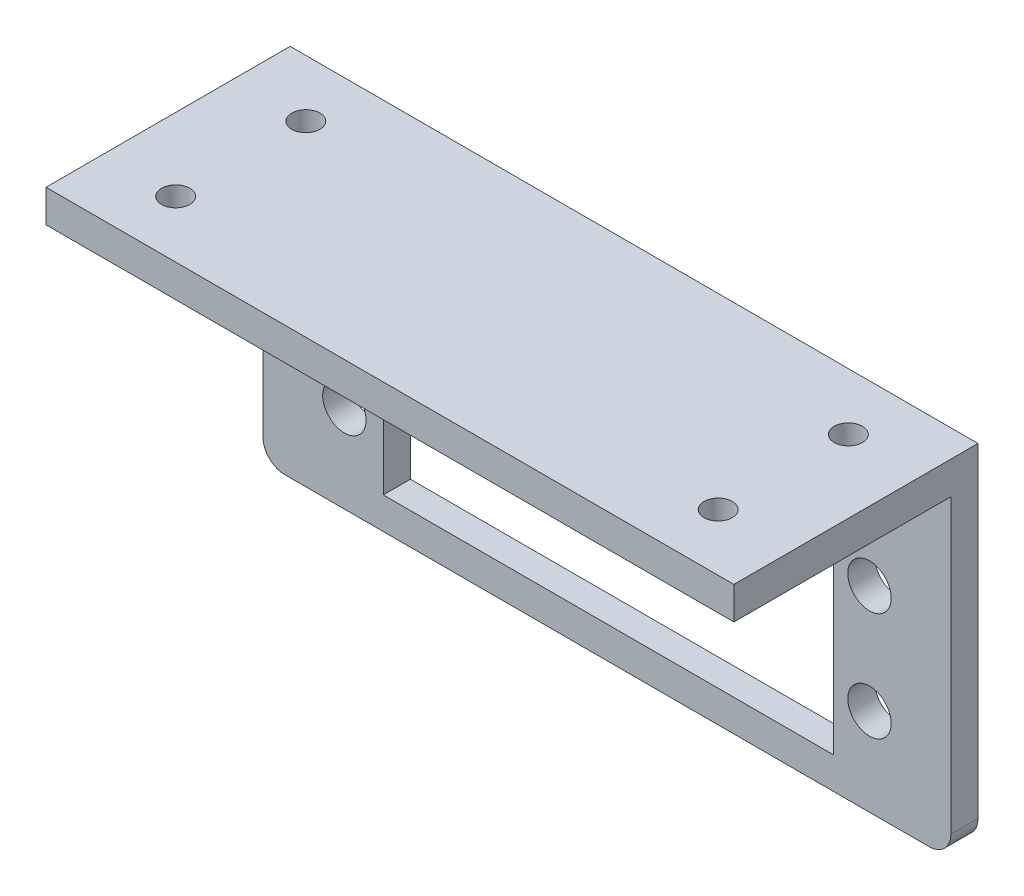
ISO-10303-21;
HEADER;
FILE_DESCRIPTION(('STEP AP214'),'2;1');
FILE_NAME('part.step','',(''),(''),'','','');
FILE_SCHEMA(('AUTOMOTIVE_DESIGN { 1 0 10303 214 1 1 1 1 }'));
ENDSEC;
DATA;
#1=APPLICATION_CONTEXT('core data for automotive mechanical design processes');
#2=APPLICATION_PROTOCOL_DEFINITION('international standard','automotive_design',2000,#1);
#3=PRODUCT_CONTEXT('',#1,'mechanical');
#4=PRODUCT('Part','Part','',(#3));
#5=PRODUCT_RELATED_PRODUCT_CATEGORY('part','',(#4));
#6=PRODUCT_DEFINITION_FORMATION('','',#4);
#7=PRODUCT_DEFINITION_CONTEXT('part definition',#1,'design');
#8=PRODUCT_DEFINITION('design','',#6,#7);
#9=PRODUCT_DEFINITION_SHAPE('','',#8);
#10=(LENGTH_UNIT() NAMED_UNIT(*) SI_UNIT(.MILLI.,.METRE.));
#11=(NAMED_UNIT(*) PLANE_ANGLE_UNIT() SI_UNIT($,.RADIAN.));
#12=(NAMED_UNIT(*) SI_UNIT($,.STERADIAN.) SOLID_ANGLE_UNIT());
#13=UNCERTAINTY_MEASURE_WITH_UNIT(LENGTH_MEASURE(1.E-05),#10,'distance_accuracy_value','');
#14=(GEOMETRIC_REPRESENTATION_CONTEXT(3) GLOBAL_UNCERTAINTY_ASSIGNED_CONTEXT((#13)) GLOBAL_UNIT_ASSIGNED_CONTEXT((#10,
#11,#12)) REPRESENTATION_CONTEXT('',''));
#15=CARTESIAN_POINT('',(0.,0.,0.));
#16=DIRECTION('',(0.,0.,1.));
#17=DIRECTION('',(1.,0.,0.));
#18=AXIS2_PLACEMENT_3D('',#15,#16,#17);
#19=CARTESIAN_POINT('',(9.10277923176895,-2.36025351629169,2.5));
#20=DIRECTION('',(0.,0.,1.));
#21=DIRECTION('',(1.,0.,0.));
#22=AXIS2_PLACEMENT_3D('',#19,#20,#21);
#23=PLANE('',#22);
#24=DIRECTION('',(1.,0.,0.));
#25=VECTOR('',#24,1.);
#26=CARTESIAN_POINT('',(7.10277923176895,24.5774686115369,2.5));
#27=LINE('',#26,#25);
#28=CARTESIAN_POINT('',(7.10277923176896,24.5774686115369,2.5));
#29=VERTEX_POINT('',#28);
#30=CARTESIAN_POINT('',(70.5028221491274,24.5774686115369,2.5));
#31=VERTEX_POINT('',#30);
#32=EDGE_CURVE('E52',#29,#31,#27,.T.);
#33=ORIENTED_EDGE('',*,*,#32,.F.);
#34=DIRECTION('',(0.,-1.,0.));
#35=VECTOR('',#34,1.);
#36=CARTESIAN_POINT('',(7.10277923176896,-2.36025351629169,2.5));
#37=LINE('',#36,#35);
#38=CARTESIAN_POINT('',(7.10277923176896,-2.36025351629169,2.5));
#39=VERTEX_POINT('',#38);
#40=EDGE_CURVE('E149',#29,#39,#37,.T.);
#41=ORIENTED_EDGE('',*,*,#40,.T.);
#42=CARTESIAN_POINT('',(9.10277923176895,-2.36025351629169,2.5));
#43=DIRECTION('',(0.,0.,1.));
#44=DIRECTION('',(1.,0.,0.));
#45=AXIS2_PLACEMENT_3D('',#42,#43,#44);
#46=CIRCLE('',#45,2.);
#47=CARTESIAN_POINT('',(9.10277923176895,-4.36025351629169,2.5));
#48=VERTEX_POINT('',#47);
#49=EDGE_CURVE('E212',#39,#48,#46,.T.);
#50=ORIENTED_EDGE('',*,*,#49,.T.);
#51=DIRECTION('',(1.,0.,0.));
#52=VECTOR('',#51,1.);
#53=CARTESIAN_POINT('',(9.10277923176895,-4.36025351629169,2.5));
#54=LINE('',#53,#52);
#55=CARTESIAN_POINT('',(68.5028221491274,-4.36025351629169,2.5));
#56=VERTEX_POINT('',#55);
#57=EDGE_CURVE('E214',#48,#56,#54,.T.);
#58=ORIENTED_EDGE('',*,*,#57,.T.);
#59=CARTESIAN_POINT('',(68.5028221491274,-2.36025351629169,2.5));
#60=DIRECTION('',(0.,0.,1.));
#61=DIRECTION('',(-1.,0.,0.));
#62=AXIS2_PLACEMENT_3D('',#59,#60,#61);
#63=CIRCLE('',#62,2.);
#64=CARTESIAN_POINT('',(70.5028221491274,-2.36025351629169,2.5));
#65=VERTEX_POINT('',#64);
#66=EDGE_CURVE('E216',#56,#65,#63,.T.);
#67=ORIENTED_EDGE('',*,*,#66,.T.);
#68=DIRECTION('',(0.,1.,0.));
#69=VECTOR('',#68,1.);
#70=CARTESIAN_POINT('',(70.5028221491274,-2.36025351629169,2.5));
#71=LINE('',#70,#69);
#72=EDGE_CURVE('E208',#65,#31,#71,.T.);
#73=ORIENTED_EDGE('',*,*,#72,.T.);
#74=EDGE_LOOP('',(#33,#41,#50,#58,#67,#73));
#75=FACE_BOUND('',#74,.T.);
#76=CARTESIAN_POINT('',(63.0028221491273,3.71523363978402,2.5));
#77=DIRECTION('',(0.,0.,1.));
#78=DIRECTION('',(-1.,0.,0.));
#79=AXIS2_PLACEMENT_3D('',#76,#77,#78);
#80=CIRCLE('',#79,2.00000000061193);
#81=CARTESIAN_POINT('',(61.0028221485154,3.71523363978402,2.5));
#82=VERTEX_POINT('',#81);
#83=EDGE_CURVE('E190',#82,#82,#80,.T.);
#84=ORIENTED_EDGE('',*,*,#83,.F.);
#85=EDGE_LOOP('',(#84));
#86=FACE_BOUND('',#85,.T.);
#87=CARTESIAN_POINT('',(14.6027803468909,13.715233639784,2.5));
#88=DIRECTION('',(0.,0.,1.));
#89=DIRECTION('',(1.,0.,0.));
#90=AXIS2_PLACEMENT_3D('',#87,#88,#89);
#91=CIRCLE('',#90,2.);
#92=CARTESIAN_POINT('',(16.6027803468909,13.715233639784,2.5));
#93=VERTEX_POINT('',#92);
#94=EDGE_CURVE('E202',#93,#93,#91,.T.);
#95=ORIENTED_EDGE('',*,*,#94,.F.);
#96=EDGE_LOOP('',(#95));
#97=FACE_BOUND('',#96,.T.);
#98=CARTESIAN_POINT('',(14.602779231769,3.71523363978401,2.5));
#99=DIRECTION('',(0.,0.,1.));
#100=DIRECTION('',(1.,0.,0.));
#101=AXIS2_PLACEMENT_3D('',#98,#99,#100);
#102=CIRCLE('',#101,2.00000000015146);
#103=CARTESIAN_POINT('',(16.6027792319205,3.71523363978401,2.5));
#104=VERTEX_POINT('',#103);
#105=EDGE_CURVE('E196',#104,#104,#102,.T.);
#106=ORIENTED_EDGE('',*,*,#105,.F.);
#107=EDGE_LOOP('',(#106));
#108=FACE_BOUND('',#107,.T.);
#109=CARTESIAN_POINT('',(63.0028210340055,13.715233639784,2.5));
#110=DIRECTION('',(0.,0.,1.));
#111=DIRECTION('',(-1.,0.,0.));
#112=AXIS2_PLACEMENT_3D('',#109,#110,#111);
#113=CIRCLE('',#112,2.);
#114=CARTESIAN_POINT('',(61.0028210340055,13.715233639784,2.5));
#115=VERTEX_POINT('',#114);
#116=EDGE_CURVE('E184',#115,#115,#113,.T.);
#117=ORIENTED_EDGE('',*,*,#116,.F.);
#118=EDGE_LOOP('',(#117));
#119=FACE_BOUND('',#118,.T.);
#120=DIRECTION('',(0.,1.,0.));
#121=VECTOR('',#120,1.);
#122=CARTESIAN_POINT('',(59.6885885433482,-1.43476636021599,2.5));
#123=LINE('',#122,#121);
#124=CARTESIAN_POINT('',(59.6885885433482,-1.43476636021599,2.5));
#125=VERTEX_POINT('',#124);
#126=CARTESIAN_POINT('',(59.6885885433482,19.065233639784,2.5));
#127=VERTEX_POINT('',#126);
#128=EDGE_CURVE('E160',#125,#127,#123,.T.);
#129=ORIENTED_EDGE('',*,*,#128,.F.);
#130=DIRECTION('',(1.,0.,0.));
#131=VECTOR('',#130,1.);
#132=CARTESIAN_POINT('',(18.1885885433482,-1.43476636021599,2.5));
#133=LINE('',#132,#131);
#134=CARTESIAN_POINT('',(18.1885885433482,-1.43476636021599,2.5));
#135=VERTEX_POINT('',#134);
#136=EDGE_CURVE('E158',#135,#125,#133,.T.);
#137=ORIENTED_EDGE('',*,*,#136,.F.);
#138=DIRECTION('',(0.,-1.,0.));
#139=VECTOR('',#138,1.);
#140=CARTESIAN_POINT('',(18.1885885433482,-1.43476636021599,2.5));
#141=LINE('',#140,#139);
#142=CARTESIAN_POINT('',(18.1885885433482,19.065233639784,2.5));
#143=VERTEX_POINT('',#142);
#144=EDGE_CURVE('E165',#143,#135,#141,.T.);
#145=ORIENTED_EDGE('',*,*,#144,.F.);
#146=DIRECTION('',(-1.,0.,0.));
#147=VECTOR('',#146,1.);
#148=CARTESIAN_POINT('',(18.1885885433482,19.065233639784,2.5));
#149=LINE('',#148,#147);
#150=EDGE_CURVE('E163',#127,#143,#149,.T.);
#151=ORIENTED_EDGE('',*,*,#150,.F.);
#152=EDGE_LOOP('',(#129,#137,#145,#151));
#153=FACE_BOUND('',#152,.T.);
#154=ADVANCED_FACE('F37',(#75,#86,#97,#108,#119,#153),#23,.T.);
#155=CARTESIAN_POINT('',(9.10277923176895,-2.36025351629169,0.));
#156=DIRECTION('',(0.,0.,1.));
#157=DIRECTION('',(1.,0.,0.));
#158=AXIS2_PLACEMENT_3D('',#155,#156,#157);
#159=PLANE('',#158);
#160=CARTESIAN_POINT('',(63.0028210340055,13.715233639784,0.));
#161=DIRECTION('',(0.,0.,1.));
#162=DIRECTION('',(-1.,0.,0.));
#163=AXIS2_PLACEMENT_3D('',#160,#161,#162);
#164=CIRCLE('',#163,2.);
#165=CARTESIAN_POINT('',(61.0028210340055,13.715233639784,0.));
#166=VERTEX_POINT('',#165);
#167=EDGE_CURVE('E183',#166,#166,#164,.T.);
#168=ORIENTED_EDGE('',*,*,#167,.T.);
#169=EDGE_LOOP('',(#168));
#170=FACE_BOUND('',#169,.T.);
#171=CARTESIAN_POINT('',(63.0028221491273,3.71523363978402,0.));
#172=DIRECTION('',(0.,0.,1.));
#173=DIRECTION('',(-1.,0.,0.));
#174=AXIS2_PLACEMENT_3D('',#171,#172,#173);
#175=CIRCLE('',#174,2.00000000061193);
#176=CARTESIAN_POINT('',(61.0028221485154,3.71523363978402,0.));
#177=VERTEX_POINT('',#176);
#178=EDGE_CURVE('E187',#177,#177,#175,.T.);
#179=ORIENTED_EDGE('',*,*,#178,.T.);
#180=EDGE_LOOP('',(#179));
#181=FACE_BOUND('',#180,.T.);
#182=CARTESIAN_POINT('',(14.602779231769,3.71523363978401,0.));
#183=DIRECTION('',(0.,0.,1.));
#184=DIRECTION('',(1.,0.,0.));
#185=AXIS2_PLACEMENT_3D('',#182,#183,#184);
#186=CIRCLE('',#185,2.00000000015146);
#187=CARTESIAN_POINT('',(16.6027792319205,3.71523363978401,0.));
#188=VERTEX_POINT('',#187);
#189=EDGE_CURVE('E193',#188,#188,#186,.T.);
#190=ORIENTED_EDGE('',*,*,#189,.T.);
#191=EDGE_LOOP('',(#190));
#192=FACE_BOUND('',#191,.T.);
#193=CARTESIAN_POINT('',(14.6027803468909,13.715233639784,0.));
#194=DIRECTION('',(0.,0.,1.));
#195=DIRECTION('',(1.,0.,0.));
#196=AXIS2_PLACEMENT_3D('',#193,#194,#195);
#197=CIRCLE('',#196,2.);
#198=CARTESIAN_POINT('',(16.6027803468909,13.715233639784,0.));
#199=VERTEX_POINT('',#198);
#200=EDGE_CURVE('E199',#199,#199,#197,.T.);
#201=ORIENTED_EDGE('',*,*,#200,.T.);
#202=EDGE_LOOP('',(#201));
#203=FACE_BOUND('',#202,.T.);
#204=DIRECTION('',(0.,1.,0.));
#205=VECTOR('',#204,1.);
#206=CARTESIAN_POINT('',(70.5028221491274,-2.36025351629169,0.));
#207=LINE('',#206,#205);
#208=CARTESIAN_POINT('',(70.5028221491274,-2.36025351629169,0.));
#209=VERTEX_POINT('',#208);
#210=CARTESIAN_POINT('',(70.5028221491274,27.5774686115369,0.));
#211=VERTEX_POINT('',#210);
#212=EDGE_CURVE('E205',#209,#211,#207,.T.);
#213=ORIENTED_EDGE('',*,*,#212,.F.);
#214=CARTESIAN_POINT('',(68.5028221491274,-2.36025351629169,0.));
#215=DIRECTION('',(0.,0.,1.));
#216=DIRECTION('',(-1.,0.,0.));
#217=AXIS2_PLACEMENT_3D('',#214,#215,#216);
#218=CIRCLE('',#217,2.);
#219=CARTESIAN_POINT('',(68.5028221491274,-4.36025351629169,0.));
#220=VERTEX_POINT('',#219);
#221=EDGE_CURVE('E210',#220,#209,#218,.T.);
#222=ORIENTED_EDGE('',*,*,#221,.F.);
#223=DIRECTION('',(1.,0.,0.));
#224=VECTOR('',#223,1.);
#225=CARTESIAN_POINT('',(9.10277923176895,-4.36025351629169,0.));
#226=LINE('',#225,#224);
#227=CARTESIAN_POINT('',(9.10277923176895,-4.36025351629169,0.));
#228=VERTEX_POINT('',#227);
#229=EDGE_CURVE('E227',#228,#220,#226,.T.);
#230=ORIENTED_EDGE('',*,*,#229,.F.);
#231=CARTESIAN_POINT('',(9.10277923176895,-2.36025351629169,0.));
#232=DIRECTION('',(0.,0.,1.));
#233=DIRECTION('',(1.,0.,0.));
#234=AXIS2_PLACEMENT_3D('',#231,#232,#233);
#235=CIRCLE('',#234,2.);
#236=CARTESIAN_POINT('',(7.10277923176896,-2.36025351629169,0.));
#237=VERTEX_POINT('',#236);
#238=EDGE_CURVE('E225',#237,#228,#235,.T.);
#239=ORIENTED_EDGE('',*,*,#238,.F.);
#240=DIRECTION('',(0.,-1.,0.));
#241=VECTOR('',#240,1.);
#242=CARTESIAN_POINT('',(7.10277923176896,-2.36025351629169,0.));
#243=LINE('',#242,#241);
#244=CARTESIAN_POINT('',(7.10277923176896,27.5774686115369,0.));
#245=VERTEX_POINT('',#244);
#246=EDGE_CURVE('E223',#245,#237,#243,.T.);
#247=ORIENTED_EDGE('',*,*,#246,.F.);
#248=DIRECTION('',(-1.,0.,0.));
#249=VECTOR('',#248,1.);
#250=CARTESIAN_POINT('',(7.10277923176896,27.5774686115369,0.));
#251=LINE('',#250,#249);
#252=EDGE_CURVE('E221',#211,#245,#251,.T.);
#253=ORIENTED_EDGE('',*,*,#252,.F.);
#254=EDGE_LOOP('',(#213,#222,#230,#239,#247,#253));
#255=FACE_BOUND('',#254,.T.);
#256=DIRECTION('',(1.,0.,0.));
#257=VECTOR('',#256,1.);
#258=CARTESIAN_POINT('',(18.1885885433482,-1.43476636021599,0.));
#259=LINE('',#258,#257);
#260=CARTESIAN_POINT('',(18.1885885433482,-1.43476636021599,0.));
#261=VERTEX_POINT('',#260);
#262=CARTESIAN_POINT('',(59.6885885433482,-1.43476636021599,0.));
#263=VERTEX_POINT('',#262);
#264=EDGE_CURVE('E150',#261,#263,#259,.T.);
#265=ORIENTED_EDGE('',*,*,#264,.T.);
#266=DIRECTION('',(0.,1.,0.));
#267=VECTOR('',#266,1.);
#268=CARTESIAN_POINT('',(59.6885885433482,-1.43476636021599,0.));
#269=LINE('',#268,#267);
#270=CARTESIAN_POINT('',(59.6885885433482,19.065233639784,0.));
#271=VERTEX_POINT('',#270);
#272=EDGE_CURVE('E153',#263,#271,#269,.T.);
#273=ORIENTED_EDGE('',*,*,#272,.T.);
#274=DIRECTION('',(-1.,0.,0.));
#275=VECTOR('',#274,1.);
#276=CARTESIAN_POINT('',(18.1885885433482,19.065233639784,0.));
#277=LINE('',#276,#275);
#278=CARTESIAN_POINT('',(18.1885885433482,19.065233639784,0.));
#279=VERTEX_POINT('',#278);
#280=EDGE_CURVE('E170',#271,#279,#277,.T.);
#281=ORIENTED_EDGE('',*,*,#280,.T.);
#282=DIRECTION('',(0.,-1.,0.));
#283=VECTOR('',#282,1.);
#284=CARTESIAN_POINT('',(18.1885885433482,-1.43476636021599,0.));
#285=LINE('',#284,#283);
#286=EDGE_CURVE('E161',#279,#261,#285,.T.);
#287=ORIENTED_EDGE('',*,*,#286,.T.);
#288=EDGE_LOOP('',(#265,#273,#281,#287));
#289=FACE_BOUND('',#288,.T.);
#290=ADVANCED_FACE('F245',(#170,#181,#192,#203,#255,#289),#159,.F.);
#291=CARTESIAN_POINT('',(70.5028221491274,-2.36025351629169,2.5));
#292=DIRECTION('',(-1.,0.,0.));
#293=DIRECTION('',(0.,0.,1.));
#294=AXIS2_PLACEMENT_3D('',#291,#292,#293);
#295=PLANE('',#294);
#296=ORIENTED_EDGE('',*,*,#212,.T.);
#297=DIRECTION('',(0.,0.,-1.));
#298=VECTOR('',#297,1.);
#299=CARTESIAN_POINT('',(70.5028221491274,27.5774686115369,2.5));
#300=LINE('',#299,#298);
#301=CARTESIAN_POINT('',(70.5028221491274,27.5774686115369,22.5));
#302=VERTEX_POINT('',#301);
#303=EDGE_CURVE('E11',#302,#211,#300,.T.);
#304=ORIENTED_EDGE('',*,*,#303,.F.);
#305=DIRECTION('',(0.,1.,0.));
#306=VECTOR('',#305,1.);
#307=CARTESIAN_POINT('',(70.5028221491274,27.5774686115369,22.5));
#308=LINE('',#307,#306);
#309=CARTESIAN_POINT('',(70.5028221491274,24.5774686115369,22.5));
#310=VERTEX_POINT('',#309);
#311=EDGE_CURVE('E136',#310,#302,#308,.T.);
#312=ORIENTED_EDGE('',*,*,#311,.F.);
#313=DIRECTION('',(0.,0.,-1.));
#314=VECTOR('',#313,1.);
#315=CARTESIAN_POINT('',(70.5028221491274,24.5774686115369,22.5));
#316=LINE('',#315,#314);
#317=EDGE_CURVE('E132',#310,#31,#316,.T.);
#318=ORIENTED_EDGE('',*,*,#317,.T.);
#319=ORIENTED_EDGE('',*,*,#72,.F.);
#320=DIRECTION('',(0.,0.,-1.));
#321=VECTOR('',#320,1.);
#322=CARTESIAN_POINT('',(70.5028221491274,-2.36025351629169,2.5));
#323=LINE('',#322,#321);
#324=EDGE_CURVE('E218',#65,#209,#323,.T.);
#325=ORIENTED_EDGE('',*,*,#324,.T.);
#326=EDGE_LOOP('',(#296,#304,#312,#318,#319,#325));
#327=FACE_BOUND('',#326,.T.);
#328=ADVANCED_FACE('F39',(#327),#295,.F.);
#329=CARTESIAN_POINT('',(7.10277923176896,27.5774686115369,2.5));
#330=DIRECTION('',(0.,-1.,0.));
#331=DIRECTION('',(0.,0.,-1.));
#332=AXIS2_PLACEMENT_3D('',#329,#330,#331);
#333=PLANE('',#332);
#334=CARTESIAN_POINT('',(13.8028006904482,27.5774686115369,17.25));
#335=DIRECTION('',(0.,1.,0.));
#336=DIRECTION('',(0.,0.,-1.));
#337=AXIS2_PLACEMENT_3D('',#334,#335,#336);
#338=CIRCLE('',#337,1.3);
#339=CARTESIAN_POINT('',(13.8028006904482,27.5774686115369,15.95));
#340=VERTEX_POINT('',#339);
#341=EDGE_CURVE('E280',#340,#340,#338,.T.);
#342=ORIENTED_EDGE('',*,*,#341,.F.);
#343=EDGE_LOOP('',(#342));
#344=FACE_BOUND('',#343,.T.);
#345=CARTESIAN_POINT('',(63.8028006904482,27.5774686115369,17.25));
#346=DIRECTION('',(0.,1.,0.));
#347=DIRECTION('',(0.,0.,1.));
#348=AXIS2_PLACEMENT_3D('',#345,#346,#347);
#349=CIRCLE('',#348,1.29999999999999);
#350=CARTESIAN_POINT('',(63.8028006904482,27.5774686115369,18.55));
#351=VERTEX_POINT('',#350);
#352=EDGE_CURVE('E279',#351,#351,#349,.T.);
#353=ORIENTED_EDGE('',*,*,#352,.F.);
#354=EDGE_LOOP('',(#353));
#355=FACE_BOUND('',#354,.T.);
#356=CARTESIAN_POINT('',(63.8028006904482,27.5774686115369,5.25));
#357=DIRECTION('',(0.,1.,0.));
#358=DIRECTION('',(0.,0.,-1.));
#359=AXIS2_PLACEMENT_3D('',#356,#357,#358);
#360=CIRCLE('',#359,1.29999999999999);
#361=CARTESIAN_POINT('',(63.8028006904482,27.5774686115369,3.95000000000001));
#362=VERTEX_POINT('',#361);
#363=EDGE_CURVE('E286',#362,#362,#360,.T.);
#364=ORIENTED_EDGE('',*,*,#363,.F.);
#365=EDGE_LOOP('',(#364));
#366=FACE_BOUND('',#365,.T.);
#367=CARTESIAN_POINT('',(13.8028006904481,27.5774686115369,5.25000000000001));
#368=DIRECTION('',(0.,1.,0.));
#369=DIRECTION('',(0.,0.,1.));
#370=AXIS2_PLACEMENT_3D('',#367,#368,#369);
#371=CIRCLE('',#370,1.3);
#372=CARTESIAN_POINT('',(13.8028006904481,27.5774686115369,6.55000000000001));
#373=VERTEX_POINT('',#372);
#374=EDGE_CURVE('E268',#373,#373,#371,.T.);
#375=ORIENTED_EDGE('',*,*,#374,.F.);
#376=EDGE_LOOP('',(#375));
#377=FACE_BOUND('',#376,.T.);
#378=ORIENTED_EDGE('',*,*,#252,.T.);
#379=DIRECTION('',(0.,0.,-1.));
#380=VECTOR('',#379,1.);
#381=CARTESIAN_POINT('',(7.10277923176896,27.5774686115369,2.5));
#382=LINE('',#381,#380);
#383=CARTESIAN_POINT('',(7.10277923176896,27.5774686115369,22.5));
#384=VERTEX_POINT('',#383);
#385=EDGE_CURVE('E45',#384,#245,#382,.T.);
#386=ORIENTED_EDGE('',*,*,#385,.F.);
#387=DIRECTION('',(-1.,0.,0.));
#388=VECTOR('',#387,1.);
#389=CARTESIAN_POINT('',(7.10277923176896,27.5774686115369,22.5));
#390=LINE('',#389,#388);
#391=EDGE_CURVE('E143',#302,#384,#390,.T.);
#392=ORIENTED_EDGE('',*,*,#391,.F.);
#393=ORIENTED_EDGE('',*,*,#303,.T.);
#394=EDGE_LOOP('',(#378,#386,#392,#393));
#395=FACE_BOUND('',#394,.T.);
#396=ADVANCED_FACE('F296',(#344,#355,#366,#377,#395),#333,.F.);
#397=CARTESIAN_POINT('',(7.10277923176896,-2.36025351629169,2.5));
#398=DIRECTION('',(1.,0.,0.));
#399=DIRECTION('',(0.,0.,-1.));
#400=AXIS2_PLACEMENT_3D('',#397,#398,#399);
#401=PLANE('',#400);
#402=ORIENTED_EDGE('',*,*,#246,.T.);
#403=DIRECTION('',(0.,0.,-1.));
#404=VECTOR('',#403,1.);
#405=CARTESIAN_POINT('',(7.10277923176896,-2.36025351629169,2.5));
#406=LINE('',#405,#404);
#407=EDGE_CURVE('E238',#39,#237,#406,.T.);
#408=ORIENTED_EDGE('',*,*,#407,.F.);
#409=ORIENTED_EDGE('',*,*,#40,.F.);
#410=DIRECTION('',(0.,0.,-1.));
#411=VECTOR('',#410,1.);
#412=CARTESIAN_POINT('',(7.10277923176895,24.5774686115369,22.5));
#413=LINE('',#412,#411);
#414=CARTESIAN_POINT('',(7.10277923176895,24.5774686115369,22.5));
#415=VERTEX_POINT('',#414);
#416=EDGE_CURVE('E130',#415,#29,#413,.T.);
#417=ORIENTED_EDGE('',*,*,#416,.F.);
#418=DIRECTION('',(0.,-1.,0.));
#419=VECTOR('',#418,1.);
#420=CARTESIAN_POINT('',(7.10277923176896,27.5774686115369,22.5));
#421=LINE('',#420,#419);
#422=EDGE_CURVE('E137',#384,#415,#421,.T.);
#423=ORIENTED_EDGE('',*,*,#422,.F.);
#424=ORIENTED_EDGE('',*,*,#385,.T.);
#425=EDGE_LOOP('',(#402,#408,#409,#417,#423,#424));
#426=FACE_BOUND('',#425,.T.);
#427=ADVANCED_FACE('F147',(#426),#401,.F.);
#428=CARTESIAN_POINT('',(9.10277923176895,-2.36025351629169,2.5));
#429=DIRECTION('',(0.,0.,-1.));
#430=DIRECTION('',(-1.,0.,0.));
#431=AXIS2_PLACEMENT_3D('',#428,#429,#430);
#432=CYLINDRICAL_SURFACE('',#431,2.);
#433=ORIENTED_EDGE('',*,*,#238,.T.);
#434=DIRECTION('',(0.,0.,-1.));
#435=VECTOR('',#434,1.);
#436=CARTESIAN_POINT('',(9.10277923176895,-4.36025351629169,2.5));
#437=LINE('',#436,#435);
#438=EDGE_CURVE('E235',#48,#228,#437,.T.);
#439=ORIENTED_EDGE('',*,*,#438,.F.);
#440=ORIENTED_EDGE('',*,*,#49,.F.);
#441=ORIENTED_EDGE('',*,*,#407,.T.);
#442=EDGE_LOOP('',(#433,#439,#440,#441));
#443=FACE_BOUND('',#442,.T.);
#444=ADVANCED_FACE('F251',(#443),#432,.T.);
#445=CARTESIAN_POINT('',(9.10277923176895,-4.36025351629169,2.5));
#446=DIRECTION('',(0.,1.,0.));
#447=DIRECTION('',(0.,0.,1.));
#448=AXIS2_PLACEMENT_3D('',#445,#446,#447);
#449=PLANE('',#448);
#450=ORIENTED_EDGE('',*,*,#229,.T.);
#451=DIRECTION('',(0.,0.,-1.));
#452=VECTOR('',#451,1.);
#453=CARTESIAN_POINT('',(68.5028221491274,-4.36025351629169,2.5));
#454=LINE('',#453,#452);
#455=EDGE_CURVE('E232',#56,#220,#454,.T.);
#456=ORIENTED_EDGE('',*,*,#455,.F.);
#457=ORIENTED_EDGE('',*,*,#57,.F.);
#458=ORIENTED_EDGE('',*,*,#438,.T.);
#459=EDGE_LOOP('',(#450,#456,#457,#458));
#460=FACE_BOUND('',#459,.T.);
#461=ADVANCED_FACE('F255',(#460),#449,.F.);
#462=CARTESIAN_POINT('',(68.5028221491274,-2.36025351629169,2.5));
#463=DIRECTION('',(0.,0.,-1.));
#464=DIRECTION('',(-1.,0.,0.));
#465=AXIS2_PLACEMENT_3D('',#462,#463,#464);
#466=CYLINDRICAL_SURFACE('',#465,2.);
#467=ORIENTED_EDGE('',*,*,#221,.T.);
#468=ORIENTED_EDGE('',*,*,#324,.F.);
#469=ORIENTED_EDGE('',*,*,#66,.F.);
#470=ORIENTED_EDGE('',*,*,#455,.T.);
#471=EDGE_LOOP('',(#467,#468,#469,#470));
#472=FACE_BOUND('',#471,.T.);
#473=ADVANCED_FACE('F262',(#472),#466,.T.);
#474=CARTESIAN_POINT('',(14.6027803468909,13.715233639784,2.5));
#475=DIRECTION('',(0.,0.,-1.));
#476=DIRECTION('',(-1.,0.,0.));
#477=AXIS2_PLACEMENT_3D('',#474,#475,#476);
#478=CYLINDRICAL_SURFACE('',#477,2.);
#479=ORIENTED_EDGE('',*,*,#94,.T.);
#480=EDGE_LOOP('',(#479));
#481=FACE_BOUND('',#480,.T.);
#482=ORIENTED_EDGE('',*,*,#200,.F.);
#483=EDGE_LOOP('',(#482));
#484=FACE_BOUND('',#483,.T.);
#485=ADVANCED_FACE('F322',(#481,#484),#478,.F.);
#486=CARTESIAN_POINT('',(14.602779231769,3.71523363978401,2.5));
#487=DIRECTION('',(0.,0.,-1.));
#488=DIRECTION('',(-1.,0.,0.));
#489=AXIS2_PLACEMENT_3D('',#486,#487,#488);
#490=CYLINDRICAL_SURFACE('',#489,2.00000000015146);
#491=ORIENTED_EDGE('',*,*,#105,.T.);
#492=EDGE_LOOP('',(#491));
#493=FACE_BOUND('',#492,.T.);
#494=ORIENTED_EDGE('',*,*,#189,.F.);
#495=EDGE_LOOP('',(#494));
#496=FACE_BOUND('',#495,.T.);
#497=ADVANCED_FACE('F358',(#493,#496),#490,.F.);
#498=CARTESIAN_POINT('',(63.0028221491273,3.71523363978402,2.5));
#499=DIRECTION('',(0.,0.,-1.));
#500=DIRECTION('',(-1.,0.,0.));
#501=AXIS2_PLACEMENT_3D('',#498,#499,#500);
#502=CYLINDRICAL_SURFACE('',#501,2.00000000061193);
#503=ORIENTED_EDGE('',*,*,#83,.T.);
#504=EDGE_LOOP('',(#503));
#505=FACE_BOUND('',#504,.T.);
#506=ORIENTED_EDGE('',*,*,#178,.F.);
#507=EDGE_LOOP('',(#506));
#508=FACE_BOUND('',#507,.T.);
#509=ADVANCED_FACE('F365',(#505,#508),#502,.F.);
#510=CARTESIAN_POINT('',(63.0028210340055,13.715233639784,2.5));
#511=DIRECTION('',(0.,0.,-1.));
#512=DIRECTION('',(-1.,0.,0.));
#513=AXIS2_PLACEMENT_3D('',#510,#511,#512);
#514=CYLINDRICAL_SURFACE('',#513,2.);
#515=ORIENTED_EDGE('',*,*,#116,.T.);
#516=EDGE_LOOP('',(#515));
#517=FACE_BOUND('',#516,.T.);
#518=ORIENTED_EDGE('',*,*,#167,.F.);
#519=EDGE_LOOP('',(#518));
#520=FACE_BOUND('',#519,.T.);
#521=ADVANCED_FACE('F372',(#517,#520),#514,.F.);
#522=CARTESIAN_POINT('',(18.1885885433482,-1.43476636021599,2.5));
#523=DIRECTION('',(0.,1.,0.));
#524=DIRECTION('',(0.,0.,1.));
#525=AXIS2_PLACEMENT_3D('',#522,#523,#524);
#526=PLANE('',#525);
#527=ORIENTED_EDGE('',*,*,#264,.F.);
#528=DIRECTION('',(0.,0.,-1.));
#529=VECTOR('',#528,1.);
#530=CARTESIAN_POINT('',(18.1885885433482,-1.43476636021599,2.5));
#531=LINE('',#530,#529);
#532=EDGE_CURVE('E166',#135,#261,#531,.T.);
#533=ORIENTED_EDGE('',*,*,#532,.F.);
#534=ORIENTED_EDGE('',*,*,#136,.T.);
#535=DIRECTION('',(0.,0.,-1.));
#536=VECTOR('',#535,1.);
#537=CARTESIAN_POINT('',(59.6885885433482,-1.43476636021599,2.5));
#538=LINE('',#537,#536);
#539=EDGE_CURVE('E180',#125,#263,#538,.T.);
#540=ORIENTED_EDGE('',*,*,#539,.T.);
#541=EDGE_LOOP('',(#527,#533,#534,#540));
#542=FACE_BOUND('',#541,.T.);
#543=ADVANCED_FACE('F380',(#542),#526,.T.);
#544=CARTESIAN_POINT('',(59.6885885433482,-1.43476636021599,2.5));
#545=DIRECTION('',(-1.,0.,0.));
#546=DIRECTION('',(0.,0.,1.));
#547=AXIS2_PLACEMENT_3D('',#544,#545,#546);
#548=PLANE('',#547);
#549=ORIENTED_EDGE('',*,*,#272,.F.);
#550=ORIENTED_EDGE('',*,*,#539,.F.);
#551=ORIENTED_EDGE('',*,*,#128,.T.);
#552=DIRECTION('',(0.,0.,-1.));
#553=VECTOR('',#552,1.);
#554=CARTESIAN_POINT('',(59.6885885433482,19.065233639784,2.5));
#555=LINE('',#554,#553);
#556=EDGE_CURVE('E178',#127,#271,#555,.T.);
#557=ORIENTED_EDGE('',*,*,#556,.T.);
#558=EDGE_LOOP('',(#549,#550,#551,#557));
#559=FACE_BOUND('',#558,.T.);
#560=ADVANCED_FACE('F388',(#559),#548,.T.);
#561=CARTESIAN_POINT('',(18.1885885433482,19.065233639784,2.5));
#562=DIRECTION('',(0.,-1.,0.));
#563=DIRECTION('',(0.,0.,-1.));
#564=AXIS2_PLACEMENT_3D('',#561,#562,#563);
#565=PLANE('',#564);
#566=ORIENTED_EDGE('',*,*,#280,.F.);
#567=ORIENTED_EDGE('',*,*,#556,.F.);
#568=ORIENTED_EDGE('',*,*,#150,.T.);
#569=DIRECTION('',(0.,0.,-1.));
#570=VECTOR('',#569,1.);
#571=CARTESIAN_POINT('',(18.1885885433482,19.065233639784,2.5));
#572=LINE('',#571,#570);
#573=EDGE_CURVE('E60',#143,#279,#572,.T.);
#574=ORIENTED_EDGE('',*,*,#573,.T.);
#575=EDGE_LOOP('',(#566,#567,#568,#574));
#576=FACE_BOUND('',#575,.T.);
#577=ADVANCED_FACE('F396',(#576),#565,.T.);
#578=CARTESIAN_POINT('',(18.1885885433482,-1.43476636021599,2.5));
#579=DIRECTION('',(1.,0.,0.));
#580=DIRECTION('',(0.,0.,-1.));
#581=AXIS2_PLACEMENT_3D('',#578,#579,#580);
#582=PLANE('',#581);
#583=ORIENTED_EDGE('',*,*,#286,.F.);
#584=ORIENTED_EDGE('',*,*,#573,.F.);
#585=ORIENTED_EDGE('',*,*,#144,.T.);
#586=ORIENTED_EDGE('',*,*,#532,.T.);
#587=EDGE_LOOP('',(#583,#584,#585,#586));
#588=FACE_BOUND('',#587,.T.);
#589=ADVANCED_FACE('F404',(#588),#582,.T.);
#590=CARTESIAN_POINT('',(7.10277923176895,24.5774686115369,22.5));
#591=DIRECTION('',(0.,1.,0.));
#592=DIRECTION('',(0.,0.,1.));
#593=AXIS2_PLACEMENT_3D('',#590,#591,#592);
#594=PLANE('',#593);
#595=CARTESIAN_POINT('',(13.8028006904482,24.5774686115369,17.25));
#596=DIRECTION('',(0.,1.,0.));
#597=DIRECTION('',(0.,0.,1.));
#598=AXIS2_PLACEMENT_3D('',#595,#596,#597);
#599=CIRCLE('',#598,1.3);
#600=CARTESIAN_POINT('',(13.8028006904482,24.5774686115369,18.55));
#601=VERTEX_POINT('',#600);
#602=EDGE_CURVE('E276',#601,#601,#599,.F.);
#603=ORIENTED_EDGE('',*,*,#602,.F.);
#604=EDGE_LOOP('',(#603));
#605=FACE_BOUND('',#604,.T.);
#606=CARTESIAN_POINT('',(63.8028006904482,24.5774686115369,17.25));
#607=DIRECTION('',(0.,1.,0.));
#608=DIRECTION('',(0.,0.,1.));
#609=AXIS2_PLACEMENT_3D('',#606,#607,#608);
#610=CIRCLE('',#609,1.29999999999999);
#611=CARTESIAN_POINT('',(63.8028006904482,24.5774686115369,18.55));
#612=VERTEX_POINT('',#611);
#613=EDGE_CURVE('E283',#612,#612,#610,.F.);
#614=ORIENTED_EDGE('',*,*,#613,.F.);
#615=EDGE_LOOP('',(#614));
#616=FACE_BOUND('',#615,.T.);
#617=CARTESIAN_POINT('',(63.8028006904482,24.5774686115369,5.25));
#618=DIRECTION('',(0.,1.,0.));
#619=DIRECTION('',(0.,0.,1.));
#620=AXIS2_PLACEMENT_3D('',#617,#618,#619);
#621=CIRCLE('',#620,1.29999999999999);
#622=CARTESIAN_POINT('',(63.8028006904482,24.5774686115369,6.55));
#623=VERTEX_POINT('',#622);
#624=EDGE_CURVE('E273',#623,#623,#621,.F.);
#625=ORIENTED_EDGE('',*,*,#624,.F.);
#626=EDGE_LOOP('',(#625));
#627=FACE_BOUND('',#626,.T.);
#628=CARTESIAN_POINT('',(13.8028006904481,24.5774686115369,5.25000000000001));
#629=DIRECTION('',(0.,1.,0.));
#630=DIRECTION('',(0.,0.,1.));
#631=AXIS2_PLACEMENT_3D('',#628,#629,#630);
#632=CIRCLE('',#631,1.3);
#633=CARTESIAN_POINT('',(13.8028006904481,24.5774686115369,6.55000000000001));
#634=VERTEX_POINT('',#633);
#635=EDGE_CURVE('E266',#634,#634,#632,.F.);
#636=ORIENTED_EDGE('',*,*,#635,.F.);
#637=EDGE_LOOP('',(#636));
#638=FACE_BOUND('',#637,.T.);
#639=ORIENTED_EDGE('',*,*,#32,.T.);
#640=ORIENTED_EDGE('',*,*,#317,.F.);
#641=DIRECTION('',(1.,0.,0.));
#642=VECTOR('',#641,1.);
#643=CARTESIAN_POINT('',(7.10277923176895,24.5774686115369,22.5));
#644=LINE('',#643,#642);
#645=EDGE_CURVE('E126',#415,#310,#644,.T.);
#646=ORIENTED_EDGE('',*,*,#645,.F.);
#647=ORIENTED_EDGE('',*,*,#416,.T.);
#648=EDGE_LOOP('',(#639,#640,#646,#647));
#649=FACE_BOUND('',#648,.T.);
#650=ADVANCED_FACE('F128',(#605,#616,#627,#638,#649),#594,.F.);
#651=CARTESIAN_POINT('',(0.,0.,22.5));
#652=DIRECTION('',(0.,0.,1.));
#653=DIRECTION('',(1.,0.,0.));
#654=AXIS2_PLACEMENT_3D('',#651,#652,#653);
#655=PLANE('',#654);
#656=ORIENTED_EDGE('',*,*,#422,.T.);
#657=ORIENTED_EDGE('',*,*,#645,.T.);
#658=ORIENTED_EDGE('',*,*,#311,.T.);
#659=ORIENTED_EDGE('',*,*,#391,.T.);
#660=EDGE_LOOP('',(#656,#657,#658,#659));
#661=FACE_BOUND('',#660,.T.);
#662=ADVANCED_FACE('F141',(#661),#655,.T.);
#663=CARTESIAN_POINT('',(13.8028006904481,20.9005133493668,5.25000000000001));
#664=DIRECTION('',(0.,1.,0.));
#665=DIRECTION('',(0.,0.,1.));
#666=AXIS2_PLACEMENT_3D('',#663,#664,#665);
#667=CYLINDRICAL_SURFACE('',#666,1.3);
#668=ORIENTED_EDGE('',*,*,#635,.T.);
#669=EDGE_LOOP('',(#668));
#670=FACE_BOUND('',#669,.T.);
#671=ORIENTED_EDGE('',*,*,#374,.T.);
#672=EDGE_LOOP('',(#671));
#673=FACE_BOUND('',#672,.T.);
#674=ADVANCED_FACE('F302',(#670,#673),#667,.F.);
#675=CARTESIAN_POINT('',(63.8028006904482,20.9005133493668,5.25));
#676=DIRECTION('',(0.,1.,0.));
#677=DIRECTION('',(0.,0.,1.));
#678=AXIS2_PLACEMENT_3D('',#675,#676,#677);
#679=CYLINDRICAL_SURFACE('',#678,1.29999999999999);
#680=ORIENTED_EDGE('',*,*,#624,.T.);
#681=EDGE_LOOP('',(#680));
#682=FACE_BOUND('',#681,.T.);
#683=ORIENTED_EDGE('',*,*,#363,.T.);
#684=EDGE_LOOP('',(#683));
#685=FACE_BOUND('',#684,.T.);
#686=ADVANCED_FACE('F294',(#682,#685),#679,.F.);
#687=CARTESIAN_POINT('',(63.8028006904482,20.9005133493668,17.25));
#688=DIRECTION('',(0.,1.,0.));
#689=DIRECTION('',(0.,0.,1.));
#690=AXIS2_PLACEMENT_3D('',#687,#688,#689);
#691=CYLINDRICAL_SURFACE('',#690,1.29999999999999);
#692=ORIENTED_EDGE('',*,*,#613,.T.);
#693=EDGE_LOOP('',(#692));
#694=FACE_BOUND('',#693,.T.);
#695=ORIENTED_EDGE('',*,*,#352,.T.);
#696=EDGE_LOOP('',(#695));
#697=FACE_BOUND('',#696,.T.);
#698=ADVANCED_FACE('F309',(#694,#697),#691,.F.);
#699=CARTESIAN_POINT('',(13.8028006904482,20.9005133493668,17.25));
#700=DIRECTION('',(0.,1.,0.));
#701=DIRECTION('',(0.,0.,1.));
#702=AXIS2_PLACEMENT_3D('',#699,#700,#701);
#703=CYLINDRICAL_SURFACE('',#702,1.3);
#704=ORIENTED_EDGE('',*,*,#602,.T.);
#705=EDGE_LOOP('',(#704));
#706=FACE_BOUND('',#705,.T.);
#707=ORIENTED_EDGE('',*,*,#341,.T.);
#708=EDGE_LOOP('',(#707));
#709=FACE_BOUND('',#708,.T.);
#710=ADVANCED_FACE('F494',(#706,#709),#703,.F.);
#711=CLOSED_SHELL('',(#154,#290,#328,#396,#427,#444,#461,#473,#485,#497,#509,#521,#543,#560,
#577,#589,#650,#662,#674,#686,#698,#710));
#712=MANIFOLD_SOLID_BREP('B2',#711);
#713=ADVANCED_BREP_SHAPE_REPRESENTATION('',(#18,#712),#14);
#714=SHAPE_DEFINITION_REPRESENTATION(#9,#713);
ENDSEC;
END-ISO-10303-21;
